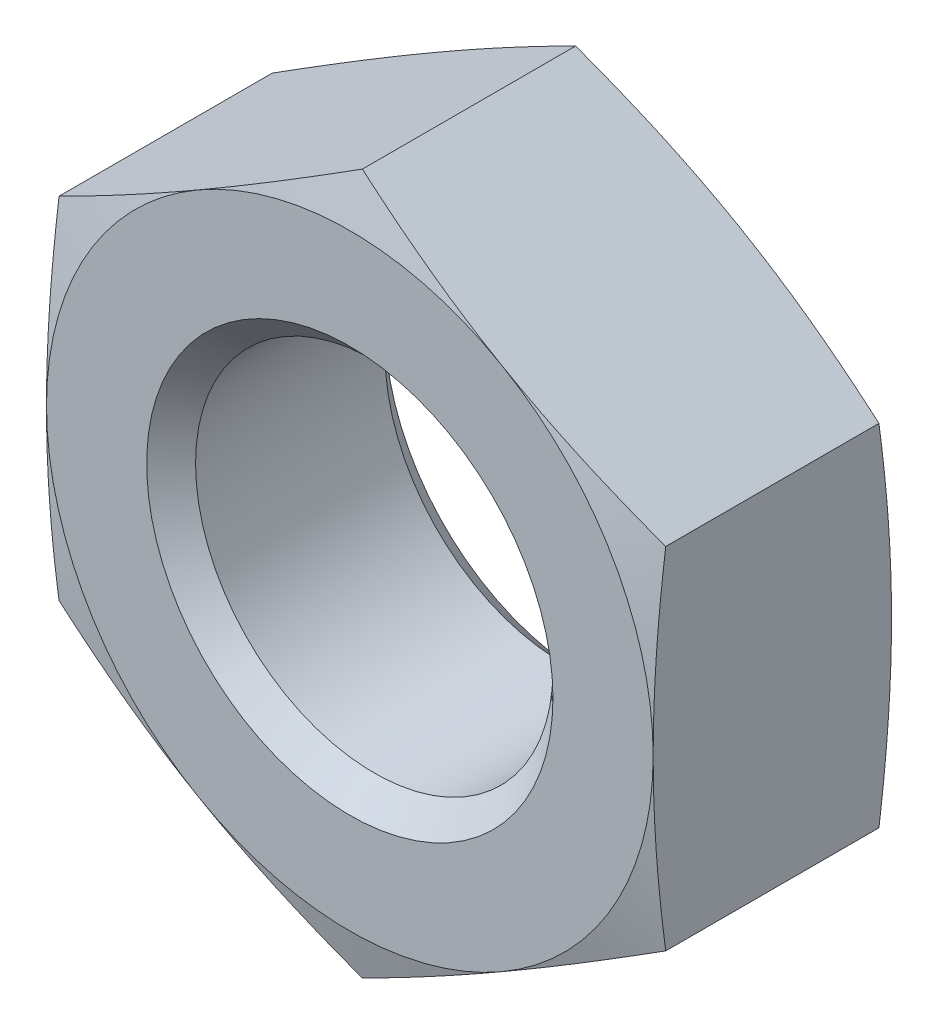
ISO-10303-21;
HEADER;
FILE_DESCRIPTION(('STEP AP214'),'2;1');
FILE_NAME('part.step','',(''),(''),'','','');
FILE_SCHEMA(('AUTOMOTIVE_DESIGN { 1 0 10303 214 1 1 1 1 }'));
ENDSEC;
DATA;
#1=APPLICATION_CONTEXT('core data for automotive mechanical design processes');
#2=APPLICATION_PROTOCOL_DEFINITION('international standard','automotive_design',2000,#1);
#3=PRODUCT_CONTEXT('',#1,'mechanical');
#4=PRODUCT('Part','Part','',(#3));
#5=PRODUCT_RELATED_PRODUCT_CATEGORY('part','',(#4));
#6=PRODUCT_DEFINITION_FORMATION('','',#4);
#7=PRODUCT_DEFINITION_CONTEXT('part definition',#1,'design');
#8=PRODUCT_DEFINITION('design','',#6,#7);
#9=PRODUCT_DEFINITION_SHAPE('','',#8);
#10=(LENGTH_UNIT() NAMED_UNIT(*) SI_UNIT(.MILLI.,.METRE.));
#11=(NAMED_UNIT(*) PLANE_ANGLE_UNIT() SI_UNIT($,.RADIAN.));
#12=(NAMED_UNIT(*) SI_UNIT($,.STERADIAN.) SOLID_ANGLE_UNIT());
#13=UNCERTAINTY_MEASURE_WITH_UNIT(LENGTH_MEASURE(1.E-05),#10,'distance_accuracy_value','');
#14=(GEOMETRIC_REPRESENTATION_CONTEXT(3) GLOBAL_UNCERTAINTY_ASSIGNED_CONTEXT((#13)) GLOBAL_UNIT_ASSIGNED_CONTEXT((#10,
#11,#12)) REPRESENTATION_CONTEXT('',''));
#15=CARTESIAN_POINT('',(0.,0.,0.));
#16=DIRECTION('',(0.,0.,1.));
#17=DIRECTION('',(1.,0.,0.));
#18=AXIS2_PLACEMENT_3D('',#15,#16,#17);
#19=CARTESIAN_POINT('',(0.,0.,-0.38113093131403));
#20=DIRECTION('',(0.,0.,-1.));
#21=DIRECTION('',(-1.,0.,0.));
#22=AXIS2_PLACEMENT_3D('',#19,#20,#21);
#23=CONICAL_SURFACE('',#22,8.5344,1.30899693899575);
#24=CARTESIAN_POINT('',(-7.112,-10.8621903802248,-1.57322706787647));
#25=CARTESIAN_POINT('',(-7.112,-10.5395393800562,-1.50091696809899));
#26=CARTESIAN_POINT('',(-7.112,-10.2166865718283,-1.42949122415335));
#27=CARTESIAN_POINT('',(-7.112,-9.57047822851532,-1.28888580152898));
#28=CARTESIAN_POINT('',(-7.112,-9.24712267234835,-1.21970621985545));
#29=CARTESIAN_POINT('',(-7.112,-8.5995200627725,-1.08401027295991));
#30=CARTESIAN_POINT('',(-7.112,-8.27527244600282,-1.01749658678487));
#31=CARTESIAN_POINT('',(-7.112,-7.62610232214974,-0.887850374036113));
#32=CARTESIAN_POINT('',(-7.112,-7.30117982078632,-0.8247178189261));
#33=CARTESIAN_POINT('',(-7.112,-6.65313387237915,-0.703125566688923));
#34=CARTESIAN_POINT('',(-7.112,-6.33001668255371,-0.644632684578964));
#35=CARTESIAN_POINT('',(-7.112,-5.68290093786014,-0.532753637731037));
#36=CARTESIAN_POINT('',(-7.112,-5.35890240254682,-0.479367360625761));
#37=CARTESIAN_POINT('',(-7.112,-4.70996107077876,-0.378903566930172));
#38=CARTESIAN_POINT('',(-7.112,-4.38501839561018,-0.331825273692812));
#39=CARTESIAN_POINT('',(-7.112,-3.73409901356861,-0.245364767985313));
#40=CARTESIAN_POINT('',(-7.112,-3.40812230572716,-0.2059825627253));
#41=CARTESIAN_POINT('',(-7.112,-2.75145723580076,-0.136029395787059));
#42=CARTESIAN_POINT('',(-7.112,-2.42075747702392,-0.105563829583138));
#43=CARTESIAN_POINT('',(-7.112,-1.75852657520964,-0.0555456253999336));
#44=CARTESIAN_POINT('',(-7.112,-1.42699545141392,-0.0359927371490908));
#45=CARTESIAN_POINT('',(-7.112,-0.763582735895716,-0.00894029218373607));
#46=CARTESIAN_POINT('',(-7.112,-0.431701372123297,-0.00143525798414603));
#47=CARTESIAN_POINT('',(-7.112,0.232109083172494,0.00106005450740887));
#48=CARTESIAN_POINT('',(-7.112,0.564038174654477,-0.00394965641241315));
#49=CARTESIAN_POINT('',(-7.112,1.22868554534926,-0.0262021054193241));
#50=CARTESIAN_POINT('',(-7.112,1.56140230772255,-0.043489241985777));
#51=CARTESIAN_POINT('',(-7.112,2.22605336021326,-0.0893097661187412));
#52=CARTESIAN_POINT('',(-7.112,2.55798763284348,-0.117843402671249));
#53=CARTESIAN_POINT('',(-7.112,3.2210709139855,-0.184715603901281));
#54=CARTESIAN_POINT('',(-7.112,3.55221926714478,-0.223060567325219));
#55=CARTESIAN_POINT('',(-7.112,4.21345025232476,-0.307959864517774));
#56=CARTESIAN_POINT('',(-7.112,4.54353288099616,-0.354514224060884));
#57=CARTESIAN_POINT('',(-7.112,5.18084428686068,-0.451037958316589));
#58=CARTESIAN_POINT('',(-7.112,5.48813890421502,-0.500576999648263));
#59=CARTESIAN_POINT('',(-7.112,6.1019181959131,-0.604463692319849));
#60=CARTESIAN_POINT('',(-7.112,6.40840284792414,-0.658811474852727));
#61=CARTESIAN_POINT('',(-7.112,7.02067434834207,-0.77143588349716));
#62=CARTESIAN_POINT('',(-7.112,7.3264611316708,-0.829712861688587));
#63=CARTESIAN_POINT('',(-7.112,7.93740665686525,-0.949478379785007));
#64=CARTESIAN_POINT('',(-7.112,8.24256539054058,-1.01096696130012));
#65=CARTESIAN_POINT('',(-7.112,9.15736958006377,-1.19937760033226));
#66=CARTESIAN_POINT('',(-7.112,9.76620698844964,-1.33021895563952));
#67=CARTESIAN_POINT('',(-7.112,10.9822626667456,-1.59898474911041));
#68=CARTESIAN_POINT('',(-7.112,11.5894810291877,-1.73690877294287));
#69=CARTESIAN_POINT('',(-7.112,12.7967984662328,-2.01636676367255));
#70=CARTESIAN_POINT('',(-7.112,13.3969088656803,-2.15785193980808));
#71=CARTESIAN_POINT('',(-7.112,14.5962924563601,-2.44436443899914));
#72=CARTESIAN_POINT('',(-7.112,15.1955656321298,-2.58939182658433));
#73=CARTESIAN_POINT('',(-7.112,16.3927321601189,-2.88188317193209));
#74=CARTESIAN_POINT('',(-7.112,16.9906263024909,-3.02934390204586));
#75=CARTESIAN_POINT('',(-7.112,18.1858937839348,-3.32627890644586));
#76=CARTESIAN_POINT('',(-7.112,18.7832671395427,-3.47575311412247));
#77=CARTESIAN_POINT('',(-7.112,19.3804589835755,-3.62594037951843));
#78=B_SPLINE_CURVE_WITH_KNOTS('',3,(#24,#25,#26,#27,#28,#29,#30,#31,#32,#33,#34,#35,#36,#37,#38,
#39,#40,#41,#42,#43,#44,#45,#46,#47,#48,#49,#50,#51,#52,#53,#54,#55,#56,#57,#58,#59,#60,#61,#62,
#63,#64,#65,#66,#67,#68,#69,#70,#71,#72,#73,#74,#75,#76,#77),.UNSPECIFIED.,.F.,.F.,(4,2,2,2,2,2,
2,2,2,2,2,2,2,2,2,2,2,2,2,2,2,2,2,2,2,2,4),(0.,0.991967628235665,1.98397803983594,
2.97696156258089,3.96993670335537,4.9550106822231,5.94006298023104,6.92499388567646,
7.90992571385571,8.90606843566219,9.90218831097408,10.8978551779253,11.893521186572,
12.8928062468735,13.8921134315661,14.8920740125303,15.8920377330598,16.825779045118,
17.7595458395382,18.6933964166397,19.6272590958812,21.495399659747,23.3634310629121,
25.213106344653,27.0628153477217,28.9102417570089,30.7576071993245),.UNSPECIFIED.);
#79=CARTESIAN_POINT('',(-7.112,-4.1061151144766,-0.294805801336327));
#80=VERTEX_POINT('',#79);
#81=CARTESIAN_POINT('',(-7.112,0.,0.));
#82=VERTEX_POINT('',#81);
#83=EDGE_CURVE('E280',#80,#82,#78,.T.);
#84=ORIENTED_EDGE('',*,*,#83,.F.);
#85=CARTESIAN_POINT('',(0.0002,-8.21234569900704,-0.294836742096548));
#86=CARTESIAN_POINT('',(-0.295160069183277,-8.04181948355621,-0.249125164728857));
#87=CARTESIAN_POINT('',(-0.591055659518147,-7.87098408482435,-0.207626596794983));
#88=CARTESIAN_POINT('',(-1.18389181695524,-7.5287099697427,-0.134717505456002));
#89=CARTESIAN_POINT('',(-1.48083275914363,-7.35727103683681,-0.103311079605053));
#90=CARTESIAN_POINT('',(-2.07395926847522,-7.01482928701071,-0.0524197564883157));
#91=CARTESIAN_POINT('',(-2.370140824909,-6.84382878567467,-0.0328741692317747));
#92=CARTESIAN_POINT('',(-2.96288164368979,-6.50160971439191,-0.00666553721840107));
#93=CARTESIAN_POINT('',(-3.2594408218449,-6.3303911930534,0.));
#94=CARTESIAN_POINT('',(-3.85255917815511,-5.9879541503764,0.));
#95=CARTESIAN_POINT('',(-4.14911835631021,-5.81673562903789,-0.00666553721840278));
#96=CARTESIAN_POINT('',(-4.74185917509101,-5.47451655775512,-0.0328741692317779));
#97=CARTESIAN_POINT('',(-5.03804073152478,-5.30351605641908,-0.0524197564883196));
#98=CARTESIAN_POINT('',(-5.63116724085637,-4.96107430659298,-0.103311079605058));
#99=CARTESIAN_POINT('',(-5.92810818304476,-4.7896353736871,-0.134717505456008));
#100=CARTESIAN_POINT('',(-6.52094434048186,-4.44736125860545,-0.20762659679499));
#101=CARTESIAN_POINT('',(-6.81683993081672,-4.27652585987359,-0.249125164728864));
#102=CARTESIAN_POINT('',(-7.1122,-4.10599964442276,-0.294836742096555));
#103=B_SPLINE_CURVE_WITH_KNOTS('',3,(#85,#86,#87,#88,#89,#90,#91,#92,#93,#94,#95,#96,#97,#98,
#99,#100,#101,#102),.UNSPECIFIED.,.F.,.F.,(4,2,2,2,2,2,2,2,4),(0.,1.03236062173259,
2.06513986860236,3.09258898445301,4.11983925526856,5.14708952608412,6.17453864193476,
7.20731788880454,8.23967851053712),.UNSPECIFIED.);
#104=CARTESIAN_POINT('',(-3.55599999999998,-6.15917267171491,0.));
#105=VERTEX_POINT('',#104);
#106=EDGE_CURVE('E156',#105,#80,#103,.T.);
#107=ORIENTED_EDGE('',*,*,#106,.F.);
#108=CARTESIAN_POINT('',(0.,0.,0.));
#109=DIRECTION('',(0.,0.,1.));
#110=DIRECTION('',(1.,0.,0.));
#111=AXIS2_PLACEMENT_3D('',#108,#109,#110);
#112=CIRCLE('',#111,7.112);
#113=EDGE_CURVE('E260',#82,#105,#112,.T.);
#114=ORIENTED_EDGE('',*,*,#113,.F.);
#115=EDGE_LOOP('',(#84,#107,#114));
#116=FACE_BOUND('',#115,.T.);
#117=ADVANCED_FACE('F37',(#116),#23,.T.);
#118=CARTESIAN_POINT('',(-7.112,4.1061151144766,-0.294805801336327));
#119=VERTEX_POINT('',#118);
#120=EDGE_CURVE('E277',#82,#119,#78,.T.);
#121=ORIENTED_EDGE('',*,*,#120,.F.);
#122=CARTESIAN_POINT('',(-3.55599999999998,6.15917267171491,0.));
#123=VERTEX_POINT('',#122);
#124=EDGE_CURVE('E261',#123,#82,#112,.T.);
#125=ORIENTED_EDGE('',*,*,#124,.F.);
#126=CARTESIAN_POINT('',(-7.1122,4.10599964442276,-0.294836742096555));
#127=CARTESIAN_POINT('',(-6.81683993081672,4.27652585987359,-0.249125164728864));
#128=CARTESIAN_POINT('',(-6.52094434048185,4.44736125860545,-0.20762659679499));
#129=CARTESIAN_POINT('',(-5.92810818304476,4.7896353736871,-0.134717505456008));
#130=CARTESIAN_POINT('',(-5.63116724085637,4.96107430659299,-0.103311079605058));
#131=CARTESIAN_POINT('',(-5.03804073152478,5.30351605641908,-0.0524197564883193));
#132=CARTESIAN_POINT('',(-4.741859175091,5.47451655775512,-0.0328741692317776));
#133=CARTESIAN_POINT('',(-4.14911835631021,5.81673562903789,-0.00666553721840267));
#134=CARTESIAN_POINT('',(-3.85255917815511,5.9879541503764,0.));
#135=CARTESIAN_POINT('',(-3.25944082184489,6.3303911930534,0.));
#136=CARTESIAN_POINT('',(-2.96288164368979,6.50160971439191,-0.00666553721840112));
#137=CARTESIAN_POINT('',(-2.370140824909,6.84382878567467,-0.0328741692317746));
#138=CARTESIAN_POINT('',(-2.07395926847522,7.01482928701071,-0.0524197564883157));
#139=CARTESIAN_POINT('',(-1.48083275914363,7.35727103683681,-0.103311079605053));
#140=CARTESIAN_POINT('',(-1.18389181695524,7.5287099697427,-0.134717505456002));
#141=CARTESIAN_POINT('',(-0.591055659518146,7.87098408482435,-0.207626596794984));
#142=CARTESIAN_POINT('',(-0.295160069183277,8.04181948355621,-0.249125164728857));
#143=CARTESIAN_POINT('',(0.000199999999999879,8.21234569900704,-0.294836742096548));
#144=B_SPLINE_CURVE_WITH_KNOTS('',3,(#126,#127,#128,#129,#130,#131,#132,#133,#134,#135,#136,
#137,#138,#139,#140,#141,#142,#143),.UNSPECIFIED.,.F.,.F.,(4,2,2,2,2,2,2,2,4),(0.,
1.03236062173259,2.06513986860236,3.09258898445301,4.11983925526856,5.14708952608412,
6.17453864193476,7.20731788880454,8.23967851053712),.UNSPECIFIED.);
#145=EDGE_CURVE('E272',#119,#123,#144,.T.);
#146=ORIENTED_EDGE('',*,*,#145,.F.);
#147=EDGE_LOOP('',(#121,#125,#146));
#148=FACE_BOUND('',#147,.T.);
#149=ADVANCED_FACE('F226',(#148),#23,.T.);
#150=CARTESIAN_POINT('',(0.,8.2122302289532,-0.29480580133632));
#151=VERTEX_POINT('',#150);
#152=EDGE_CURVE('E269',#123,#151,#144,.T.);
#153=ORIENTED_EDGE('',*,*,#152,.F.);
#154=CARTESIAN_POINT('',(3.55599999999998,6.15917267171491,0.));
#155=VERTEX_POINT('',#154);
#156=EDGE_CURVE('E45',#155,#123,#112,.T.);
#157=ORIENTED_EDGE('',*,*,#156,.F.);
#158=CARTESIAN_POINT('',(-0.0002,8.21234569900704,-0.294836742096548));
#159=CARTESIAN_POINT('',(0.295160069183277,8.04181948355621,-0.249125164728857));
#160=CARTESIAN_POINT('',(0.591055659518147,7.87098408482435,-0.207626596794983));
#161=CARTESIAN_POINT('',(1.18389181695524,7.5287099697427,-0.134717505456002));
#162=CARTESIAN_POINT('',(1.48083275914363,7.35727103683681,-0.103311079605053));
#163=CARTESIAN_POINT('',(2.07395926847522,7.01482928701071,-0.0524197564883157));
#164=CARTESIAN_POINT('',(2.370140824909,6.84382878567467,-0.0328741692317747));
#165=CARTESIAN_POINT('',(2.96288164368979,6.50160971439191,-0.00666553721840107));
#166=CARTESIAN_POINT('',(3.2594408218449,6.3303911930534,0.));
#167=CARTESIAN_POINT('',(3.85255917815511,5.9879541503764,0.));
#168=CARTESIAN_POINT('',(4.14911835631021,5.81673562903789,-0.00666553721840278));
#169=CARTESIAN_POINT('',(4.74185917509101,5.47451655775512,-0.0328741692317779));
#170=CARTESIAN_POINT('',(5.03804073152478,5.30351605641908,-0.0524197564883196));
#171=CARTESIAN_POINT('',(5.63116724085637,4.96107430659298,-0.103311079605058));
#172=CARTESIAN_POINT('',(5.92810818304476,4.7896353736871,-0.134717505456008));
#173=CARTESIAN_POINT('',(6.52094434048186,4.44736125860545,-0.20762659679499));
#174=CARTESIAN_POINT('',(6.81683993081672,4.27652585987359,-0.249125164728864));
#175=CARTESIAN_POINT('',(7.1122,4.10599964442276,-0.294836742096555));
#176=B_SPLINE_CURVE_WITH_KNOTS('',3,(#158,#159,#160,#161,#162,#163,#164,#165,#166,#167,#168,
#169,#170,#171,#172,#173,#174,#175),.UNSPECIFIED.,.F.,.F.,(4,2,2,2,2,2,2,2,4),(0.,
1.03236062173259,2.06513986860236,3.09258898445301,4.11983925526856,5.14708952608412,
6.17453864193476,7.20731788880454,8.23967851053712),.UNSPECIFIED.);
#177=EDGE_CURVE('E268',#151,#155,#176,.T.);
#178=ORIENTED_EDGE('',*,*,#177,.F.);
#179=EDGE_LOOP('',(#153,#157,#178));
#180=FACE_BOUND('',#179,.T.);
#181=ADVANCED_FACE('F232',(#180),#23,.T.);
#182=CARTESIAN_POINT('',(7.112,4.1061151144766,-0.294805801336327));
#183=VERTEX_POINT('',#182);
#184=EDGE_CURVE('E330',#155,#183,#176,.T.);
#185=ORIENTED_EDGE('',*,*,#184,.F.);
#186=CARTESIAN_POINT('',(7.112,0.,0.));
#187=VERTEX_POINT('',#186);
#188=EDGE_CURVE('E11',#187,#155,#112,.T.);
#189=ORIENTED_EDGE('',*,*,#188,.F.);
#190=CARTESIAN_POINT('',(7.112,-10.8621903802248,-1.57322706787647));
#191=CARTESIAN_POINT('',(7.112,-10.5395393800562,-1.50091696809899));
#192=CARTESIAN_POINT('',(7.112,-10.2166865718283,-1.42949122415335));
#193=CARTESIAN_POINT('',(7.112,-9.57047822851532,-1.28888580152898));
#194=CARTESIAN_POINT('',(7.112,-9.24712267234835,-1.21970621985545));
#195=CARTESIAN_POINT('',(7.112,-8.5995200627725,-1.08401027295991));
#196=CARTESIAN_POINT('',(7.112,-8.27527244600282,-1.01749658678487));
#197=CARTESIAN_POINT('',(7.112,-7.62610232214974,-0.887850374036113));
#198=CARTESIAN_POINT('',(7.112,-7.30117982078632,-0.8247178189261));
#199=CARTESIAN_POINT('',(7.112,-6.65313387237915,-0.703125566688923));
#200=CARTESIAN_POINT('',(7.112,-6.33001668255371,-0.644632684578964));
#201=CARTESIAN_POINT('',(7.112,-5.68290093786014,-0.532753637731037));
#202=CARTESIAN_POINT('',(7.112,-5.35890240254682,-0.479367360625761));
#203=CARTESIAN_POINT('',(7.112,-4.70996107077876,-0.378903566930172));
#204=CARTESIAN_POINT('',(7.112,-4.38501839561018,-0.331825273692812));
#205=CARTESIAN_POINT('',(7.112,-3.73409901356861,-0.245364767985313));
#206=CARTESIAN_POINT('',(7.112,-3.40812230572716,-0.2059825627253));
#207=CARTESIAN_POINT('',(7.112,-2.75145723580076,-0.136029395787059));
#208=CARTESIAN_POINT('',(7.112,-2.42075747702392,-0.105563829583138));
#209=CARTESIAN_POINT('',(7.112,-1.75852657520964,-0.0555456253999336));
#210=CARTESIAN_POINT('',(7.112,-1.42699545141392,-0.0359927371490908));
#211=CARTESIAN_POINT('',(7.112,-0.763582735895716,-0.00894029218373607));
#212=CARTESIAN_POINT('',(7.112,-0.431701372123297,-0.00143525798414603));
#213=CARTESIAN_POINT('',(7.112,0.232109083172494,0.00106005450740887));
#214=CARTESIAN_POINT('',(7.112,0.564038174654477,-0.00394965641241315));
#215=CARTESIAN_POINT('',(7.112,1.22868554534926,-0.0262021054193241));
#216=CARTESIAN_POINT('',(7.112,1.56140230772255,-0.043489241985777));
#217=CARTESIAN_POINT('',(7.112,2.22605336021326,-0.0893097661187412));
#218=CARTESIAN_POINT('',(7.112,2.55798763284348,-0.117843402671249));
#219=CARTESIAN_POINT('',(7.112,3.2210709139855,-0.184715603901281));
#220=CARTESIAN_POINT('',(7.112,3.55221926714478,-0.223060567325219));
#221=CARTESIAN_POINT('',(7.112,4.21345025232476,-0.307959864517774));
#222=CARTESIAN_POINT('',(7.112,4.54353288099616,-0.354514224060884));
#223=CARTESIAN_POINT('',(7.112,5.18084428686068,-0.451037958316589));
#224=CARTESIAN_POINT('',(7.112,5.48813890421502,-0.500576999648263));
#225=CARTESIAN_POINT('',(7.112,6.1019181959131,-0.604463692319849));
#226=CARTESIAN_POINT('',(7.112,6.40840284792414,-0.658811474852727));
#227=CARTESIAN_POINT('',(7.112,7.02067434834207,-0.77143588349716));
#228=CARTESIAN_POINT('',(7.112,7.3264611316708,-0.829712861688587));
#229=CARTESIAN_POINT('',(7.112,7.93740665686525,-0.949478379785007));
#230=CARTESIAN_POINT('',(7.112,8.24256539054058,-1.01096696130012));
#231=CARTESIAN_POINT('',(7.112,9.15736958006377,-1.19937760033226));
#232=CARTESIAN_POINT('',(7.112,9.76620698844964,-1.33021895563952));
#233=CARTESIAN_POINT('',(7.112,10.9822626667456,-1.59898474911041));
#234=CARTESIAN_POINT('',(7.112,11.5894810291877,-1.73690877294287));
#235=CARTESIAN_POINT('',(7.112,12.7967984662328,-2.01636676367255));
#236=CARTESIAN_POINT('',(7.112,13.3969088656803,-2.15785193980808));
#237=CARTESIAN_POINT('',(7.112,14.5962924563601,-2.44436443899914));
#238=CARTESIAN_POINT('',(7.112,15.1955656321298,-2.58939182658433));
#239=CARTESIAN_POINT('',(7.112,16.3927321601189,-2.88188317193209));
#240=CARTESIAN_POINT('',(7.112,16.9906263024909,-3.02934390204586));
#241=CARTESIAN_POINT('',(7.112,18.1858937839348,-3.32627890644586));
#242=CARTESIAN_POINT('',(7.112,18.7832671395427,-3.47575311412247));
#243=CARTESIAN_POINT('',(7.112,19.3804589835755,-3.62594037951843));
#244=B_SPLINE_CURVE_WITH_KNOTS('',3,(#190,#191,#192,#193,#194,#195,#196,#197,#198,#199,#200,
#201,#202,#203,#204,#205,#206,#207,#208,#209,#210,#211,#212,#213,#214,#215,#216,#217,#218,#219,
#220,#221,#222,#223,#224,#225,#226,#227,#228,#229,#230,#231,#232,#233,#234,#235,#236,#237,#238,
#239,#240,#241,#242,#243),.UNSPECIFIED.,.F.,.F.,(4,2,2,2,2,2,2,2,2,2,2,2,2,2,2,2,2,2,2,2,2,2,2,
2,2,2,4),(0.,0.991967628235665,1.98397803983594,2.97696156258089,3.96993670335537,
4.9550106822231,5.94006298023104,6.92499388567646,7.90992571385571,8.90606843566219,
9.90218831097408,10.8978551779253,11.893521186572,12.8928062468735,13.8921134315661,
14.8920740125303,15.8920377330598,16.825779045118,17.7595458395382,18.6933964166397,
19.6272590958812,21.495399659747,23.3634310629121,25.213106344653,27.0628153477217,
28.9102417570089,30.7576071993245),.UNSPECIFIED.);
#245=EDGE_CURVE('E328',#183,#187,#244,.F.);
#246=ORIENTED_EDGE('',*,*,#245,.F.);
#247=EDGE_LOOP('',(#185,#189,#246));
#248=FACE_BOUND('',#247,.T.);
#249=ADVANCED_FACE('F244',(#248),#23,.T.);
#250=CARTESIAN_POINT('',(7.112,-4.1061151144766,-0.294805801336327));
#251=VERTEX_POINT('',#250);
#252=EDGE_CURVE('E254',#187,#251,#244,.F.);
#253=ORIENTED_EDGE('',*,*,#252,.F.);
#254=CARTESIAN_POINT('',(3.55599999999998,-6.15917267171491,0.));
#255=VERTEX_POINT('',#254);
#256=EDGE_CURVE('E46',#255,#187,#112,.T.);
#257=ORIENTED_EDGE('',*,*,#256,.F.);
#258=CARTESIAN_POINT('',(7.1122,-4.10599964442276,-0.294836742096555));
#259=CARTESIAN_POINT('',(6.81683993081672,-4.27652585987359,-0.249125164728864));
#260=CARTESIAN_POINT('',(6.52094434048185,-4.44736125860545,-0.20762659679499));
#261=CARTESIAN_POINT('',(5.92810818304476,-4.7896353736871,-0.134717505456008));
#262=CARTESIAN_POINT('',(5.63116724085637,-4.96107430659299,-0.103311079605058));
#263=CARTESIAN_POINT('',(5.03804073152478,-5.30351605641908,-0.0524197564883193));
#264=CARTESIAN_POINT('',(4.741859175091,-5.47451655775512,-0.0328741692317776));
#265=CARTESIAN_POINT('',(4.14911835631021,-5.81673562903789,-0.00666553721840267));
#266=CARTESIAN_POINT('',(3.85255917815511,-5.9879541503764,0.));
#267=CARTESIAN_POINT('',(3.25944082184489,-6.3303911930534,0.));
#268=CARTESIAN_POINT('',(2.96288164368979,-6.50160971439191,-0.00666553721840112));
#269=CARTESIAN_POINT('',(2.370140824909,-6.84382878567467,-0.0328741692317746));
#270=CARTESIAN_POINT('',(2.07395926847522,-7.01482928701071,-0.0524197564883157));
#271=CARTESIAN_POINT('',(1.48083275914363,-7.35727103683681,-0.103311079605053));
#272=CARTESIAN_POINT('',(1.18389181695524,-7.5287099697427,-0.134717505456002));
#273=CARTESIAN_POINT('',(0.591055659518146,-7.87098408482435,-0.207626596794984));
#274=CARTESIAN_POINT('',(0.295160069183277,-8.04181948355621,-0.249125164728857));
#275=CARTESIAN_POINT('',(-0.000199999999999879,-8.21234569900704,-0.294836742096548));
#276=B_SPLINE_CURVE_WITH_KNOTS('',3,(#258,#259,#260,#261,#262,#263,#264,#265,#266,#267,#268,
#269,#270,#271,#272,#273,#274,#275),.UNSPECIFIED.,.F.,.F.,(4,2,2,2,2,2,2,2,4),(0.,
1.03236062173259,2.06513986860236,3.09258898445301,4.11983925526856,5.14708952608412,
6.17453864193476,7.20731788880454,8.23967851053712),.UNSPECIFIED.);
#277=EDGE_CURVE('E148',#251,#255,#276,.T.);
#278=ORIENTED_EDGE('',*,*,#277,.F.);
#279=EDGE_LOOP('',(#253,#257,#278));
#280=FACE_BOUND('',#279,.T.);
#281=ADVANCED_FACE('F237',(#280),#23,.T.);
#282=CARTESIAN_POINT('',(0.,-8.2122302289532,-0.29480580133632));
#283=VERTEX_POINT('',#282);
#284=EDGE_CURVE('E140',#255,#283,#276,.T.);
#285=ORIENTED_EDGE('',*,*,#284,.F.);
#286=EDGE_CURVE('E249',#105,#255,#112,.T.);
#287=ORIENTED_EDGE('',*,*,#286,.F.);
#288=EDGE_CURVE('E53',#283,#105,#103,.T.);
#289=ORIENTED_EDGE('',*,*,#288,.F.);
#290=EDGE_LOOP('',(#285,#287,#289));
#291=FACE_BOUND('',#290,.T.);
#292=ADVANCED_FACE('F228',(#291),#23,.T.);
#293=CARTESIAN_POINT('',(0.,0.,0.));
#294=DIRECTION('',(0.,0.,-1.));
#295=DIRECTION('',(-1.,0.,0.));
#296=AXIS2_PLACEMENT_3D('',#293,#294,#295);
#297=PLANE('',#296);
#298=CARTESIAN_POINT('',(0.,0.,0.));
#299=DIRECTION('',(0.,0.,1.));
#300=DIRECTION('',(1.,0.,0.));
#301=AXIS2_PLACEMENT_3D('',#298,#299,#300);
#302=CIRCLE('',#301,4.7625);
#303=CARTESIAN_POINT('',(4.7625,0.,0.));
#304=VERTEX_POINT('',#303);
#305=EDGE_CURVE('E187',#304,#304,#302,.T.);
#306=ORIENTED_EDGE('',*,*,#305,.F.);
#307=EDGE_LOOP('',(#306));
#308=FACE_BOUND('',#307,.T.);
#309=ORIENTED_EDGE('',*,*,#188,.T.);
#310=ORIENTED_EDGE('',*,*,#156,.T.);
#311=ORIENTED_EDGE('',*,*,#124,.T.);
#312=ORIENTED_EDGE('',*,*,#113,.T.);
#313=ORIENTED_EDGE('',*,*,#286,.T.);
#314=ORIENTED_EDGE('',*,*,#256,.T.);
#315=EDGE_LOOP('',(#309,#310,#311,#312,#313,#314));
#316=FACE_BOUND('',#315,.T.);
#317=ADVANCED_FACE('F39',(#308,#316),#297,.F.);
#318=CARTESIAN_POINT('',(-7.112,4.1061151144766,-5.588));
#319=DIRECTION('',(-1.,0.,0.));
#320=DIRECTION('',(0.,0.,1.));
#321=AXIS2_PLACEMENT_3D('',#318,#319,#320);
#322=PLANE('',#321);
#323=ORIENTED_EDGE('',*,*,#83,.T.);
#324=ORIENTED_EDGE('',*,*,#120,.T.);
#325=DIRECTION('',(0.,0.,1.));
#326=VECTOR('',#325,1.);
#327=CARTESIAN_POINT('',(-7.112,4.1061151144766,-5.588));
#328=LINE('',#327,#326);
#329=CARTESIAN_POINT('',(-7.112,4.1061151144766,-5.2931941986637));
#330=VERTEX_POINT('',#329);
#331=EDGE_CURVE('E133',#330,#119,#328,.T.);
#332=ORIENTED_EDGE('',*,*,#331,.F.);
#333=CARTESIAN_POINT('',(-7.112,-10.8621903802248,-4.01477293212366));
#334=CARTESIAN_POINT('',(-7.112,-10.5395393800562,-4.08708303190113));
#335=CARTESIAN_POINT('',(-7.112,-10.2166865718283,-4.15850877584677));
#336=CARTESIAN_POINT('',(-7.112,-9.57047822851531,-4.29911419847113));
#337=CARTESIAN_POINT('',(-7.112,-9.24712267234835,-4.36829378014464));
#338=CARTESIAN_POINT('',(-7.112,-8.59952006277249,-4.50398972704018));
#339=CARTESIAN_POINT('',(-7.112,-8.27527244600281,-4.57050341321521));
#340=CARTESIAN_POINT('',(-7.112,-7.62610232214973,-4.70014962596396));
#341=CARTESIAN_POINT('',(-7.112,-7.30117982078632,-4.76328218107397));
#342=CARTESIAN_POINT('',(-7.112,-6.65313387237914,-4.88487443331113));
#343=CARTESIAN_POINT('',(-7.112,-6.33001668255371,-4.94336731542109));
#344=CARTESIAN_POINT('',(-7.112,-5.68290093786014,-5.05524636226901));
#345=CARTESIAN_POINT('',(-7.112,-5.35890240254682,-5.10863263937428));
#346=CARTESIAN_POINT('',(-7.112,-4.70996107077875,-5.20909643306986));
#347=CARTESIAN_POINT('',(-7.112,-4.38501839561018,-5.25617472630722));
#348=CARTESIAN_POINT('',(-7.112,-3.73409901356861,-5.34263523201471));
#349=CARTESIAN_POINT('',(-7.112,-3.40812230572716,-5.38201743727472));
#350=CARTESIAN_POINT('',(-7.112,-2.75145723580077,-5.45197060421295));
#351=CARTESIAN_POINT('',(-7.112,-2.42075747702392,-5.48243617041687));
#352=CARTESIAN_POINT('',(-7.112,-1.75852657520965,-5.53245437460007));
#353=CARTESIAN_POINT('',(-7.112,-1.42699545141393,-5.55200726285091));
#354=CARTESIAN_POINT('',(-7.112,-0.763582735895725,-5.57905970781627));
#355=CARTESIAN_POINT('',(-7.112,-0.431701372123308,-5.58656474201585));
#356=CARTESIAN_POINT('',(-7.112,0.232109083172481,-5.58906005450741));
#357=CARTESIAN_POINT('',(-7.112,0.564038174654462,-5.58405034358759));
#358=CARTESIAN_POINT('',(-7.112,1.22868554534924,-5.56179789458068));
#359=CARTESIAN_POINT('',(-7.112,1.56140230772253,-5.54451075801423));
#360=CARTESIAN_POINT('',(-7.112,2.22605336021324,-5.49869023388127));
#361=CARTESIAN_POINT('',(-7.112,2.55798763284345,-5.47015659732876));
#362=CARTESIAN_POINT('',(-7.112,3.22107091398548,-5.40328439609874));
#363=CARTESIAN_POINT('',(-7.112,3.55221926714476,-5.3649394326748));
#364=CARTESIAN_POINT('',(-7.112,4.21345025232473,-5.28004013548225));
#365=CARTESIAN_POINT('',(-7.112,4.54353288099613,-5.23348577593915));
#366=CARTESIAN_POINT('',(-7.112,5.18084428686065,-5.13696204168345));
#367=CARTESIAN_POINT('',(-7.112,5.48813890421499,-5.08742300035178));
#368=CARTESIAN_POINT('',(-7.112,6.10191819591307,-4.9835363076802));
#369=CARTESIAN_POINT('',(-7.112,6.40840284792411,-4.92918852514733));
#370=CARTESIAN_POINT('',(-7.112,7.02067434834205,-4.81656411650291));
#371=CARTESIAN_POINT('',(-7.112,7.32646113167077,-4.75828713831148));
#372=CARTESIAN_POINT('',(-7.112,7.93740665686522,-4.63852162021507));
#373=CARTESIAN_POINT('',(-7.112,8.24256539054055,-4.57703303869997));
#374=CARTESIAN_POINT('',(-7.112,9.15736958006375,-4.38862239966784));
#375=CARTESIAN_POINT('',(-7.112,9.76620698844961,-4.25778104436059));
#376=CARTESIAN_POINT('',(-7.112,10.9822626667456,-3.98901525088972));
#377=CARTESIAN_POINT('',(-7.112,11.5894810291877,-3.85109122705727));
#378=CARTESIAN_POINT('',(-7.112,12.7967984662327,-3.57163323632761));
#379=CARTESIAN_POINT('',(-7.112,13.3969088656803,-3.43014806019209));
#380=CARTESIAN_POINT('',(-7.112,14.5962924563601,-3.14363556100105));
#381=CARTESIAN_POINT('',(-7.112,15.1955656321298,-2.99860817341588));
#382=CARTESIAN_POINT('',(-7.112,16.3927321601189,-2.70611682806814));
#383=CARTESIAN_POINT('',(-7.112,16.9906263024909,-2.55865609795438));
#384=CARTESIAN_POINT('',(-7.112,18.1858937839348,-2.2617210935544));
#385=CARTESIAN_POINT('',(-7.112,18.7832671395427,-2.1122468858778));
#386=CARTESIAN_POINT('',(-7.112,19.3804589835756,-1.96205962048185));
#387=B_SPLINE_CURVE_WITH_KNOTS('',3,(#333,#334,#335,#336,#337,#338,#339,#340,#341,#342,#343,
#344,#345,#346,#347,#348,#349,#350,#351,#352,#353,#354,#355,#356,#357,#358,#359,#360,#361,#362,
#363,#364,#365,#366,#367,#368,#369,#370,#371,#372,#373,#374,#375,#376,#377,#378,#379,#380,#381,
#382,#383,#384,#385,#386),.UNSPECIFIED.,.F.,.F.,(4,2,2,2,2,2,2,2,2,2,2,2,2,2,2,2,2,2,2,2,2,2,2,
2,2,2,4),(0.,0.991967628235663,1.98397803983593,2.97696156258088,3.96993670335535,
4.95501068222308,5.94006298023102,6.92499388567644,7.90992571385569,8.90606843566216,
9.90218831097405,10.8978551779253,11.8935211865719,12.8928062468735,13.8921134315661,
14.8920740125303,15.8920377330598,16.825779045118,17.7595458395382,18.6933964166396,
19.6272590958812,21.4953996597469,23.3634310629121,25.2131063446529,27.0628153477216,
28.9102417570088,30.7576071993244),.UNSPECIFIED.);
#388=CARTESIAN_POINT('',(-7.112,0.,-5.588));
#389=VERTEX_POINT('',#388);
#390=EDGE_CURVE('E281',#330,#389,#387,.F.);
#391=ORIENTED_EDGE('',*,*,#390,.T.);
#392=CARTESIAN_POINT('',(-7.112,-4.1061151144766,-5.2931941986637));
#393=VERTEX_POINT('',#392);
#394=EDGE_CURVE('E284',#389,#393,#387,.F.);
#395=ORIENTED_EDGE('',*,*,#394,.T.);
#396=DIRECTION('',(0.,0.,1.));
#397=VECTOR('',#396,1.);
#398=CARTESIAN_POINT('',(-7.112,-4.1061151144766,-5.588));
#399=LINE('',#398,#397);
#400=EDGE_CURVE('E142',#393,#80,#399,.T.);
#401=ORIENTED_EDGE('',*,*,#400,.T.);
#402=EDGE_LOOP('',(#323,#324,#332,#391,#395,#401));
#403=FACE_BOUND('',#402,.T.);
#404=ADVANCED_FACE('F179',(#403),#322,.T.);
#405=CARTESIAN_POINT('',(0.,8.2122302289532,-5.588));
#406=DIRECTION('',(-0.499999999999998,0.86602540378444,0.));
#407=DIRECTION('',(-0.86602540378444,-0.499999999999998,0.));
#408=AXIS2_PLACEMENT_3D('',#405,#406,#407);
#409=PLANE('',#408);
#410=ORIENTED_EDGE('',*,*,#145,.T.);
#411=ORIENTED_EDGE('',*,*,#152,.T.);
#412=DIRECTION('',(0.,0.,1.));
#413=VECTOR('',#412,1.);
#414=CARTESIAN_POINT('',(0.,8.2122302289532,-5.588));
#415=LINE('',#414,#413);
#416=CARTESIAN_POINT('',(0.,8.2122302289532,-5.2931941986637));
#417=VERTEX_POINT('',#416);
#418=EDGE_CURVE('E194',#417,#151,#415,.T.);
#419=ORIENTED_EDGE('',*,*,#418,.F.);
#420=CARTESIAN_POINT('',(0.000200000000000083,8.21234569900704,-5.29316325790348));
#421=CARTESIAN_POINT('',(-0.295160069183278,8.04181948355621,-5.33887483527116));
#422=CARTESIAN_POINT('',(-0.591055659518146,7.87098408482435,-5.38037340320503));
#423=CARTESIAN_POINT('',(-1.18389181695524,7.5287099697427,-5.45328249454401));
#424=CARTESIAN_POINT('',(-1.48083275914363,7.35727103683681,-5.48468892039496));
#425=CARTESIAN_POINT('',(-2.07395926847522,7.01482928701071,-5.53558024351169));
#426=CARTESIAN_POINT('',(-2.370140824909,6.84382878567467,-5.55512583076823));
#427=CARTESIAN_POINT('',(-2.96288164368979,6.50160971439191,-5.5813344627816));
#428=CARTESIAN_POINT('',(-3.25944082184489,6.3303911930534,-5.58800000000001));
#429=CARTESIAN_POINT('',(-3.85255917815511,5.9879541503764,-5.58800000000001));
#430=CARTESIAN_POINT('',(-4.14911835631021,5.81673562903789,-5.5813344627816));
#431=CARTESIAN_POINT('',(-4.741859175091,5.47451655775512,-5.55512583076823));
#432=CARTESIAN_POINT('',(-5.03804073152478,5.30351605641908,-5.53558024351168));
#433=CARTESIAN_POINT('',(-5.63116724085637,4.96107430659299,-5.48468892039495));
#434=CARTESIAN_POINT('',(-5.92810818304476,4.7896353736871,-5.453282494544));
#435=CARTESIAN_POINT('',(-6.52094434048185,4.44736125860545,-5.38037340320503));
#436=CARTESIAN_POINT('',(-6.81683993081672,4.27652585987359,-5.33887483527116));
#437=CARTESIAN_POINT('',(-7.1122,4.10599964442276,-5.29316325790347));
#438=B_SPLINE_CURVE_WITH_KNOTS('',3,(#420,#421,#422,#423,#424,#425,#426,#427,#428,#429,#430,
#431,#432,#433,#434,#435,#436,#437),.UNSPECIFIED.,.F.,.F.,(4,2,2,2,2,2,2,2,4),(0.,
1.03236062173258,2.06513986860236,3.092588984453,4.11983925526856,5.14708952608411,
6.17453864193476,7.20731788880453,8.23967851053712),.UNSPECIFIED.);
#439=CARTESIAN_POINT('',(-3.55599999999998,6.15917267171491,-5.588));
#440=VERTEX_POINT('',#439);
#441=EDGE_CURVE('E273',#417,#440,#438,.T.);
#442=ORIENTED_EDGE('',*,*,#441,.T.);
#443=EDGE_CURVE('E320',#440,#330,#438,.T.);
#444=ORIENTED_EDGE('',*,*,#443,.T.);
#445=ORIENTED_EDGE('',*,*,#331,.T.);
#446=EDGE_LOOP('',(#410,#411,#419,#442,#444,#445));
#447=FACE_BOUND('',#446,.T.);
#448=ADVANCED_FACE('F345',(#447),#409,.T.);
#449=CARTESIAN_POINT('',(7.112,4.1061151144766,-5.588));
#450=DIRECTION('',(0.499999999999998,0.86602540378444,0.));
#451=DIRECTION('',(-0.86602540378444,0.499999999999998,0.));
#452=AXIS2_PLACEMENT_3D('',#449,#450,#451);
#453=PLANE('',#452);
#454=ORIENTED_EDGE('',*,*,#177,.T.);
#455=ORIENTED_EDGE('',*,*,#184,.T.);
#456=DIRECTION('',(0.,0.,1.));
#457=VECTOR('',#456,1.);
#458=CARTESIAN_POINT('',(7.112,4.1061151144766,-5.588));
#459=LINE('',#458,#457);
#460=CARTESIAN_POINT('',(7.112,4.1061151144766,-5.2931941986637));
#461=VERTEX_POINT('',#460);
#462=EDGE_CURVE('E191',#461,#183,#459,.T.);
#463=ORIENTED_EDGE('',*,*,#462,.F.);
#464=CARTESIAN_POINT('',(7.1122,4.10599964442276,-5.29316325790347));
#465=CARTESIAN_POINT('',(6.81683993081672,4.27652585987359,-5.33887483527116));
#466=CARTESIAN_POINT('',(6.52094434048185,4.44736125860545,-5.38037340320503));
#467=CARTESIAN_POINT('',(5.92810818304476,4.7896353736871,-5.453282494544));
#468=CARTESIAN_POINT('',(5.63116724085637,4.96107430659299,-5.48468892039495));
#469=CARTESIAN_POINT('',(5.03804073152478,5.30351605641908,-5.53558024351168));
#470=CARTESIAN_POINT('',(4.741859175091,5.47451655775512,-5.55512583076823));
#471=CARTESIAN_POINT('',(4.14911835631021,5.81673562903789,-5.5813344627816));
#472=CARTESIAN_POINT('',(3.85255917815511,5.9879541503764,-5.58800000000001));
#473=CARTESIAN_POINT('',(3.25944082184489,6.3303911930534,-5.58800000000001));
#474=CARTESIAN_POINT('',(2.96288164368979,6.50160971439191,-5.5813344627816));
#475=CARTESIAN_POINT('',(2.370140824909,6.84382878567467,-5.55512583076823));
#476=CARTESIAN_POINT('',(2.07395926847522,7.01482928701072,-5.53558024351169));
#477=CARTESIAN_POINT('',(1.48083275914363,7.35727103683681,-5.48468892039496));
#478=CARTESIAN_POINT('',(1.18389181695524,7.5287099697427,-5.45328249454401));
#479=CARTESIAN_POINT('',(0.591055659518146,7.87098408482435,-5.38037340320503));
#480=CARTESIAN_POINT('',(0.295160069183276,8.04181948355621,-5.33887483527116));
#481=CARTESIAN_POINT('',(-0.00020000000000068,8.21234569900704,-5.29316325790348));
#482=B_SPLINE_CURVE_WITH_KNOTS('',3,(#464,#465,#466,#467,#468,#469,#470,#471,#472,#473,#474,
#475,#476,#477,#478,#479,#480,#481),.UNSPECIFIED.,.F.,.F.,(4,2,2,2,2,2,2,2,4),(0.,
1.03236062173259,2.06513986860236,3.09258898445301,4.11983925526856,5.14708952608412,
6.17453864193476,7.20731788880453,8.23967851053712),.UNSPECIFIED.);
#483=CARTESIAN_POINT('',(3.55599999999998,6.15917267171491,-5.588));
#484=VERTEX_POINT('',#483);
#485=EDGE_CURVE('E327',#461,#484,#482,.T.);
#486=ORIENTED_EDGE('',*,*,#485,.T.);
#487=EDGE_CURVE('E325',#484,#417,#482,.T.);
#488=ORIENTED_EDGE('',*,*,#487,.T.);
#489=ORIENTED_EDGE('',*,*,#418,.T.);
#490=EDGE_LOOP('',(#454,#455,#463,#486,#488,#489));
#491=FACE_BOUND('',#490,.T.);
#492=ADVANCED_FACE('F342',(#491),#453,.T.);
#493=CARTESIAN_POINT('',(7.112,-4.1061151144766,-5.588));
#494=DIRECTION('',(1.,0.,0.));
#495=DIRECTION('',(0.,0.,-1.));
#496=AXIS2_PLACEMENT_3D('',#493,#494,#495);
#497=PLANE('',#496);
#498=ORIENTED_EDGE('',*,*,#245,.T.);
#499=ORIENTED_EDGE('',*,*,#252,.T.);
#500=DIRECTION('',(0.,0.,1.));
#501=VECTOR('',#500,1.);
#502=CARTESIAN_POINT('',(7.112,-4.1061151144766,-5.588));
#503=LINE('',#502,#501);
#504=CARTESIAN_POINT('',(7.112,-4.1061151144766,-5.2931941986637));
#505=VERTEX_POINT('',#504);
#506=EDGE_CURVE('E141',#505,#251,#503,.T.);
#507=ORIENTED_EDGE('',*,*,#506,.F.);
#508=CARTESIAN_POINT('',(7.112,-10.8621903802248,-4.01477293212366));
#509=CARTESIAN_POINT('',(7.112,-10.5395393800562,-4.08708303190113));
#510=CARTESIAN_POINT('',(7.112,-10.2166865718283,-4.15850877584677));
#511=CARTESIAN_POINT('',(7.112,-9.57047822851531,-4.29911419847113));
#512=CARTESIAN_POINT('',(7.112,-9.24712267234835,-4.36829378014464));
#513=CARTESIAN_POINT('',(7.112,-8.59952006277249,-4.50398972704018));
#514=CARTESIAN_POINT('',(7.112,-8.27527244600281,-4.57050341321521));
#515=CARTESIAN_POINT('',(7.112,-7.62610232214973,-4.70014962596396));
#516=CARTESIAN_POINT('',(7.112,-7.30117982078632,-4.76328218107397));
#517=CARTESIAN_POINT('',(7.112,-6.65313387237914,-4.88487443331113));
#518=CARTESIAN_POINT('',(7.112,-6.33001668255371,-4.94336731542109));
#519=CARTESIAN_POINT('',(7.112,-5.68290093786014,-5.05524636226901));
#520=CARTESIAN_POINT('',(7.112,-5.35890240254682,-5.10863263937428));
#521=CARTESIAN_POINT('',(7.112,-4.70996107077875,-5.20909643306986));
#522=CARTESIAN_POINT('',(7.112,-4.38501839561018,-5.25617472630722));
#523=CARTESIAN_POINT('',(7.112,-3.73409901356861,-5.34263523201471));
#524=CARTESIAN_POINT('',(7.112,-3.40812230572716,-5.38201743727472));
#525=CARTESIAN_POINT('',(7.112,-2.75145723580077,-5.45197060421295));
#526=CARTESIAN_POINT('',(7.112,-2.42075747702392,-5.48243617041687));
#527=CARTESIAN_POINT('',(7.112,-1.75852657520965,-5.53245437460007));
#528=CARTESIAN_POINT('',(7.112,-1.42699545141393,-5.55200726285091));
#529=CARTESIAN_POINT('',(7.112,-0.763582735895725,-5.57905970781627));
#530=CARTESIAN_POINT('',(7.112,-0.431701372123308,-5.58656474201585));
#531=CARTESIAN_POINT('',(7.112,0.232109083172481,-5.58906005450741));
#532=CARTESIAN_POINT('',(7.112,0.564038174654462,-5.58405034358759));
#533=CARTESIAN_POINT('',(7.112,1.22868554534924,-5.56179789458068));
#534=CARTESIAN_POINT('',(7.112,1.56140230772253,-5.54451075801423));
#535=CARTESIAN_POINT('',(7.112,2.22605336021324,-5.49869023388127));
#536=CARTESIAN_POINT('',(7.112,2.55798763284345,-5.47015659732876));
#537=CARTESIAN_POINT('',(7.112,3.22107091398548,-5.40328439609874));
#538=CARTESIAN_POINT('',(7.112,3.55221926714476,-5.3649394326748));
#539=CARTESIAN_POINT('',(7.112,4.21345025232473,-5.28004013548225));
#540=CARTESIAN_POINT('',(7.112,4.54353288099613,-5.23348577593915));
#541=CARTESIAN_POINT('',(7.112,5.18084428686065,-5.13696204168345));
#542=CARTESIAN_POINT('',(7.112,5.48813890421499,-5.08742300035178));
#543=CARTESIAN_POINT('',(7.112,6.10191819591307,-4.9835363076802));
#544=CARTESIAN_POINT('',(7.112,6.40840284792411,-4.92918852514733));
#545=CARTESIAN_POINT('',(7.112,7.02067434834205,-4.81656411650291));
#546=CARTESIAN_POINT('',(7.112,7.32646113167077,-4.75828713831148));
#547=CARTESIAN_POINT('',(7.112,7.93740665686522,-4.63852162021507));
#548=CARTESIAN_POINT('',(7.112,8.24256539054055,-4.57703303869997));
#549=CARTESIAN_POINT('',(7.112,9.15736958006375,-4.38862239966784));
#550=CARTESIAN_POINT('',(7.112,9.76620698844961,-4.25778104436059));
#551=CARTESIAN_POINT('',(7.112,10.9822626667456,-3.98901525088972));
#552=CARTESIAN_POINT('',(7.112,11.5894810291877,-3.85109122705727));
#553=CARTESIAN_POINT('',(7.112,12.7967984662327,-3.57163323632761));
#554=CARTESIAN_POINT('',(7.112,13.3969088656803,-3.43014806019209));
#555=CARTESIAN_POINT('',(7.112,14.5962924563601,-3.14363556100105));
#556=CARTESIAN_POINT('',(7.112,15.1955656321298,-2.99860817341588));
#557=CARTESIAN_POINT('',(7.112,16.3927321601189,-2.70611682806814));
#558=CARTESIAN_POINT('',(7.112,16.9906263024909,-2.55865609795438));
#559=CARTESIAN_POINT('',(7.112,18.1858937839348,-2.2617210935544));
#560=CARTESIAN_POINT('',(7.112,18.7832671395427,-2.1122468858778));
#561=CARTESIAN_POINT('',(7.112,19.3804589835756,-1.96205962048185));
#562=B_SPLINE_CURVE_WITH_KNOTS('',3,(#508,#509,#510,#511,#512,#513,#514,#515,#516,#517,#518,
#519,#520,#521,#522,#523,#524,#525,#526,#527,#528,#529,#530,#531,#532,#533,#534,#535,#536,#537,
#538,#539,#540,#541,#542,#543,#544,#545,#546,#547,#548,#549,#550,#551,#552,#553,#554,#555,#556,
#557,#558,#559,#560,#561),.UNSPECIFIED.,.F.,.F.,(4,2,2,2,2,2,2,2,2,2,2,2,2,2,2,2,2,2,2,2,2,2,2,
2,2,2,4),(0.,0.991967628235663,1.98397803983593,2.97696156258088,3.96993670335535,
4.95501068222308,5.94006298023102,6.92499388567644,7.90992571385569,8.90606843566216,
9.90218831097405,10.8978551779253,11.8935211865719,12.8928062468735,13.8921134315661,
14.8920740125303,15.8920377330598,16.825779045118,17.7595458395382,18.6933964166396,
19.6272590958812,21.4953996597469,23.3634310629121,25.2131063446529,27.0628153477216,
28.9102417570088,30.7576071993244),.UNSPECIFIED.);
#563=CARTESIAN_POINT('',(7.112,0.,-5.588));
#564=VERTEX_POINT('',#563);
#565=EDGE_CURVE('E554',#505,#564,#562,.T.);
#566=ORIENTED_EDGE('',*,*,#565,.T.);
#567=EDGE_CURVE('E359',#564,#461,#562,.T.);
#568=ORIENTED_EDGE('',*,*,#567,.T.);
#569=ORIENTED_EDGE('',*,*,#462,.T.);
#570=EDGE_LOOP('',(#498,#499,#507,#566,#568,#569));
#571=FACE_BOUND('',#570,.T.);
#572=ADVANCED_FACE('F171',(#571),#497,.T.);
#573=CARTESIAN_POINT('',(0.,-8.2122302289532,-5.588));
#574=DIRECTION('',(0.499999999999998,-0.86602540378444,0.));
#575=DIRECTION('',(0.86602540378444,0.499999999999998,0.));
#576=AXIS2_PLACEMENT_3D('',#573,#574,#575);
#577=PLANE('',#576);
#578=ORIENTED_EDGE('',*,*,#277,.T.);
#579=ORIENTED_EDGE('',*,*,#284,.T.);
#580=DIRECTION('',(0.,0.,1.));
#581=VECTOR('',#580,1.);
#582=CARTESIAN_POINT('',(0.,-8.2122302289532,-5.588));
#583=LINE('',#582,#581);
#584=CARTESIAN_POINT('',(0.,-8.2122302289532,-5.2931941986637));
#585=VERTEX_POINT('',#584);
#586=EDGE_CURVE('E128',#585,#283,#583,.T.);
#587=ORIENTED_EDGE('',*,*,#586,.F.);
#588=CARTESIAN_POINT('',(-0.000200000000000083,-8.21234569900704,-5.29316325790348));
#589=CARTESIAN_POINT('',(0.295160069183278,-8.04181948355621,-5.33887483527116));
#590=CARTESIAN_POINT('',(0.591055659518146,-7.87098408482435,-5.38037340320503));
#591=CARTESIAN_POINT('',(1.18389181695524,-7.5287099697427,-5.45328249454401));
#592=CARTESIAN_POINT('',(1.48083275914363,-7.35727103683681,-5.48468892039496));
#593=CARTESIAN_POINT('',(2.07395926847522,-7.01482928701071,-5.53558024351169));
#594=CARTESIAN_POINT('',(2.370140824909,-6.84382878567467,-5.55512583076823));
#595=CARTESIAN_POINT('',(2.96288164368979,-6.50160971439191,-5.5813344627816));
#596=CARTESIAN_POINT('',(3.25944082184489,-6.3303911930534,-5.58800000000001));
#597=CARTESIAN_POINT('',(3.85255917815511,-5.9879541503764,-5.58800000000001));
#598=CARTESIAN_POINT('',(4.14911835631021,-5.81673562903789,-5.5813344627816));
#599=CARTESIAN_POINT('',(4.741859175091,-5.47451655775512,-5.55512583076823));
#600=CARTESIAN_POINT('',(5.03804073152478,-5.30351605641908,-5.53558024351168));
#601=CARTESIAN_POINT('',(5.63116724085637,-4.96107430659299,-5.48468892039495));
#602=CARTESIAN_POINT('',(5.92810818304476,-4.7896353736871,-5.453282494544));
#603=CARTESIAN_POINT('',(6.52094434048185,-4.44736125860545,-5.38037340320503));
#604=CARTESIAN_POINT('',(6.81683993081672,-4.27652585987359,-5.33887483527116));
#605=CARTESIAN_POINT('',(7.1122,-4.10599964442276,-5.29316325790347));
#606=B_SPLINE_CURVE_WITH_KNOTS('',3,(#588,#589,#590,#591,#592,#593,#594,#595,#596,#597,#598,
#599,#600,#601,#602,#603,#604,#605),.UNSPECIFIED.,.F.,.F.,(4,2,2,2,2,2,2,2,4),(0.,
1.03236062173258,2.06513986860236,3.092588984453,4.11983925526856,5.14708952608411,
6.17453864193476,7.20731788880453,8.23967851053712),.UNSPECIFIED.);
#607=CARTESIAN_POINT('',(3.55599999999998,-6.15917267171491,-5.588));
#608=VERTEX_POINT('',#607);
#609=EDGE_CURVE('E137',#585,#608,#606,.T.);
#610=ORIENTED_EDGE('',*,*,#609,.T.);
#611=EDGE_CURVE('E146',#608,#505,#606,.T.);
#612=ORIENTED_EDGE('',*,*,#611,.T.);
#613=ORIENTED_EDGE('',*,*,#506,.T.);
#614=EDGE_LOOP('',(#578,#579,#587,#610,#612,#613));
#615=FACE_BOUND('',#614,.T.);
#616=ADVANCED_FACE('F136',(#615),#577,.T.);
#617=CARTESIAN_POINT('',(-7.112,-4.1061151144766,-5.588));
#618=DIRECTION('',(-0.499999999999998,-0.86602540378444,0.));
#619=DIRECTION('',(0.86602540378444,-0.499999999999998,0.));
#620=AXIS2_PLACEMENT_3D('',#617,#618,#619);
#621=PLANE('',#620);
#622=ORIENTED_EDGE('',*,*,#288,.T.);
#623=ORIENTED_EDGE('',*,*,#106,.T.);
#624=ORIENTED_EDGE('',*,*,#400,.F.);
#625=CARTESIAN_POINT('',(-7.1122,-4.10599964442276,-5.29316325790347));
#626=CARTESIAN_POINT('',(-6.81683993081672,-4.27652585987359,-5.33887483527116));
#627=CARTESIAN_POINT('',(-6.52094434048185,-4.44736125860545,-5.38037340320503));
#628=CARTESIAN_POINT('',(-5.92810818304476,-4.7896353736871,-5.453282494544));
#629=CARTESIAN_POINT('',(-5.63116724085637,-4.96107430659299,-5.48468892039495));
#630=CARTESIAN_POINT('',(-5.03804073152478,-5.30351605641908,-5.53558024351168));
#631=CARTESIAN_POINT('',(-4.741859175091,-5.47451655775512,-5.55512583076823));
#632=CARTESIAN_POINT('',(-4.14911835631021,-5.81673562903789,-5.5813344627816));
#633=CARTESIAN_POINT('',(-3.85255917815511,-5.9879541503764,-5.58800000000001));
#634=CARTESIAN_POINT('',(-3.25944082184489,-6.3303911930534,-5.58800000000001));
#635=CARTESIAN_POINT('',(-2.96288164368979,-6.50160971439191,-5.5813344627816));
#636=CARTESIAN_POINT('',(-2.370140824909,-6.84382878567467,-5.55512583076823));
#637=CARTESIAN_POINT('',(-2.07395926847522,-7.01482928701072,-5.53558024351169));
#638=CARTESIAN_POINT('',(-1.48083275914363,-7.35727103683681,-5.48468892039496));
#639=CARTESIAN_POINT('',(-1.18389181695524,-7.5287099697427,-5.45328249454401));
#640=CARTESIAN_POINT('',(-0.591055659518146,-7.87098408482435,-5.38037340320503));
#641=CARTESIAN_POINT('',(-0.295160069183276,-8.04181948355621,-5.33887483527116));
#642=CARTESIAN_POINT('',(0.00020000000000068,-8.21234569900704,-5.29316325790348));
#643=B_SPLINE_CURVE_WITH_KNOTS('',3,(#625,#626,#627,#628,#629,#630,#631,#632,#633,#634,#635,
#636,#637,#638,#639,#640,#641,#642),.UNSPECIFIED.,.F.,.F.,(4,2,2,2,2,2,2,2,4),(0.,
1.03236062173259,2.06513986860236,3.09258898445301,4.11983925526856,5.14708952608412,
6.17453864193476,7.20731788880453,8.23967851053712),.UNSPECIFIED.);
#644=CARTESIAN_POINT('',(-3.55599999999998,-6.15917267171491,-5.588));
#645=VERTEX_POINT('',#644);
#646=EDGE_CURVE('E60',#393,#645,#643,.T.);
#647=ORIENTED_EDGE('',*,*,#646,.T.);
#648=EDGE_CURVE('E125',#645,#585,#643,.T.);
#649=ORIENTED_EDGE('',*,*,#648,.T.);
#650=ORIENTED_EDGE('',*,*,#586,.T.);
#651=EDGE_LOOP('',(#622,#623,#624,#647,#649,#650));
#652=FACE_BOUND('',#651,.T.);
#653=ADVANCED_FACE('F127',(#652),#621,.T.);
#654=CARTESIAN_POINT('',(0.,0.,-5.588));
#655=DIRECTION('',(0.,0.,1.));
#656=DIRECTION('',(1.,0.,0.));
#657=AXIS2_PLACEMENT_3D('',#654,#655,#656);
#658=CONICAL_SURFACE('',#657,7.112,1.30899693899577);
#659=ORIENTED_EDGE('',*,*,#487,.F.);
#660=CARTESIAN_POINT('',(0.,0.,-5.588));
#661=DIRECTION('',(0.,0.,1.));
#662=DIRECTION('',(1.,0.,0.));
#663=AXIS2_PLACEMENT_3D('',#660,#661,#662);
#664=CIRCLE('',#663,7.112);
#665=EDGE_CURVE('E302',#484,#440,#664,.T.);
#666=ORIENTED_EDGE('',*,*,#665,.T.);
#667=ORIENTED_EDGE('',*,*,#441,.F.);
#668=EDGE_LOOP('',(#659,#666,#667));
#669=FACE_BOUND('',#668,.T.);
#670=ADVANCED_FACE('F178',(#669),#658,.T.);
#671=ORIENTED_EDGE('',*,*,#443,.F.);
#672=EDGE_CURVE('E309',#440,#389,#664,.T.);
#673=ORIENTED_EDGE('',*,*,#672,.T.);
#674=ORIENTED_EDGE('',*,*,#390,.F.);
#675=EDGE_LOOP('',(#671,#673,#674));
#676=FACE_BOUND('',#675,.T.);
#677=ADVANCED_FACE('F319',(#676),#658,.T.);
#678=ORIENTED_EDGE('',*,*,#394,.F.);
#679=EDGE_CURVE('E314',#389,#645,#664,.T.);
#680=ORIENTED_EDGE('',*,*,#679,.T.);
#681=ORIENTED_EDGE('',*,*,#646,.F.);
#682=EDGE_LOOP('',(#678,#680,#681));
#683=FACE_BOUND('',#682,.T.);
#684=ADVANCED_FACE('F402',(#683),#658,.T.);
#685=ORIENTED_EDGE('',*,*,#565,.F.);
#686=ORIENTED_EDGE('',*,*,#611,.F.);
#687=EDGE_CURVE('E303',#608,#564,#664,.T.);
#688=ORIENTED_EDGE('',*,*,#687,.T.);
#689=EDGE_LOOP('',(#685,#686,#688));
#690=FACE_BOUND('',#689,.T.);
#691=ADVANCED_FACE('F412',(#690),#658,.T.);
#692=ORIENTED_EDGE('',*,*,#485,.F.);
#693=ORIENTED_EDGE('',*,*,#567,.F.);
#694=EDGE_CURVE('E257',#564,#484,#664,.T.);
#695=ORIENTED_EDGE('',*,*,#694,.T.);
#696=EDGE_LOOP('',(#692,#693,#695));
#697=FACE_BOUND('',#696,.T.);
#698=ADVANCED_FACE('F165',(#697),#658,.T.);
#699=CARTESIAN_POINT('',(0.,7.112,-5.588));
#700=DIRECTION('',(0.,0.,1.));
#701=DIRECTION('',(1.,0.,0.));
#702=AXIS2_PLACEMENT_3D('',#699,#700,#701);
#703=PLANE('',#702);
#704=CARTESIAN_POINT('',(0.,0.,-5.588));
#705=DIRECTION('',(0.,0.,1.));
#706=DIRECTION('',(1.,0.,0.));
#707=AXIS2_PLACEMENT_3D('',#704,#705,#706);
#708=CIRCLE('',#707,4.7625);
#709=CARTESIAN_POINT('',(4.7625,0.,-5.588));
#710=VERTEX_POINT('',#709);
#711=EDGE_CURVE('E207',#710,#710,#708,.T.);
#712=ORIENTED_EDGE('',*,*,#711,.T.);
#713=EDGE_LOOP('',(#712));
#714=FACE_BOUND('',#713,.T.);
#715=ORIENTED_EDGE('',*,*,#694,.F.);
#716=ORIENTED_EDGE('',*,*,#687,.F.);
#717=EDGE_CURVE('E145',#645,#608,#664,.T.);
#718=ORIENTED_EDGE('',*,*,#717,.F.);
#719=ORIENTED_EDGE('',*,*,#679,.F.);
#720=ORIENTED_EDGE('',*,*,#672,.F.);
#721=ORIENTED_EDGE('',*,*,#665,.F.);
#722=EDGE_LOOP('',(#715,#716,#718,#719,#720,#721));
#723=FACE_BOUND('',#722,.T.);
#724=ADVANCED_FACE('F211',(#714,#723),#703,.F.);
#725=ORIENTED_EDGE('',*,*,#609,.F.);
#726=ORIENTED_EDGE('',*,*,#648,.F.);
#727=ORIENTED_EDGE('',*,*,#717,.T.);
#728=EDGE_LOOP('',(#725,#726,#727));
#729=FACE_BOUND('',#728,.T.);
#730=ADVANCED_FACE('F144',(#729),#658,.T.);
#731=CARTESIAN_POINT('',(0.,0.,-0.57277));
#732=DIRECTION('',(0.,0.,1.));
#733=DIRECTION('',(1.,0.,0.));
#734=AXIS2_PLACEMENT_3D('',#731,#732,#733);
#735=CONICAL_SURFACE('',#734,4.18973,0.785398163397448);
#736=ORIENTED_EDGE('',*,*,#305,.T.);
#737=EDGE_LOOP('',(#736));
#738=FACE_BOUND('',#737,.T.);
#739=CARTESIAN_POINT('',(0.,0.,-0.57277));
#740=DIRECTION('',(0.,0.,1.));
#741=DIRECTION('',(1.,0.,0.));
#742=AXIS2_PLACEMENT_3D('',#739,#740,#741);
#743=CIRCLE('',#742,4.18973);
#744=CARTESIAN_POINT('',(4.18973,0.,-0.57277));
#745=VERTEX_POINT('',#744);
#746=EDGE_CURVE('E201',#745,#745,#743,.T.);
#747=ORIENTED_EDGE('',*,*,#746,.F.);
#748=EDGE_LOOP('',(#747));
#749=FACE_BOUND('',#748,.T.);
#750=ADVANCED_FACE('F222',(#738,#749),#735,.F.);
#751=CARTESIAN_POINT('',(0.,0.,-5.588));
#752=DIRECTION('',(0.,0.,1.));
#753=DIRECTION('',(1.,0.,0.));
#754=AXIS2_PLACEMENT_3D('',#751,#752,#753);
#755=CYLINDRICAL_SURFACE('',#754,4.18973);
#756=ORIENTED_EDGE('',*,*,#746,.T.);
#757=EDGE_LOOP('',(#756));
#758=FACE_BOUND('',#757,.T.);
#759=CARTESIAN_POINT('',(0.,0.,-5.01523));
#760=DIRECTION('',(0.,0.,1.));
#761=DIRECTION('',(1.,0.,0.));
#762=AXIS2_PLACEMENT_3D('',#759,#760,#761);
#763=CIRCLE('',#762,4.18973);
#764=CARTESIAN_POINT('',(4.18973,0.,-5.01523));
#765=VERTEX_POINT('',#764);
#766=EDGE_CURVE('E204',#765,#765,#763,.T.);
#767=ORIENTED_EDGE('',*,*,#766,.F.);
#768=EDGE_LOOP('',(#767));
#769=FACE_BOUND('',#768,.T.);
#770=ADVANCED_FACE('F216',(#758,#769),#755,.F.);
#771=CARTESIAN_POINT('',(0.,0.,-5.588));
#772=DIRECTION('',(0.,0.,-1.));
#773=DIRECTION('',(-1.,0.,0.));
#774=AXIS2_PLACEMENT_3D('',#771,#772,#773);
#775=CONICAL_SURFACE('',#774,4.7625,0.785398163397448);
#776=ORIENTED_EDGE('',*,*,#766,.T.);
#777=EDGE_LOOP('',(#776));
#778=FACE_BOUND('',#777,.T.);
#779=ORIENTED_EDGE('',*,*,#711,.F.);
#780=EDGE_LOOP('',(#779));
#781=FACE_BOUND('',#780,.T.);
#782=ADVANCED_FACE('F214',(#778,#781),#775,.F.);
#783=CLOSED_SHELL('',(#117,#149,#181,#249,#281,#292,#317,#404,#448,#492,#572,#616,#653,#670,
#677,#684,#691,#698,#724,#730,#750,#770,#782));
#784=MANIFOLD_SOLID_BREP('B2',#783);
#785=ADVANCED_BREP_SHAPE_REPRESENTATION('',(#18,#784),#14);
#786=SHAPE_DEFINITION_REPRESENTATION(#9,#785);
ENDSEC;
END-ISO-10303-21;
